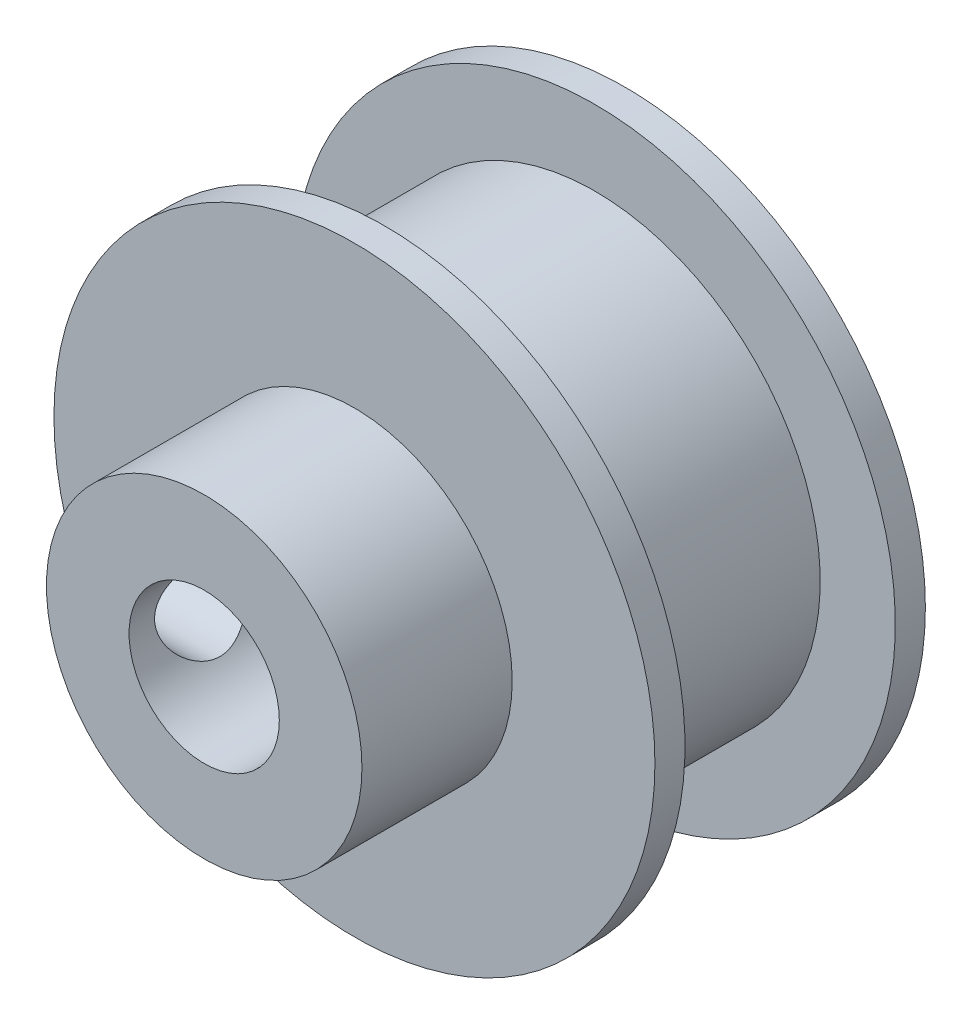
ISO-10303-21;
HEADER;
FILE_DESCRIPTION(('STEP AP214'),'2;1');
FILE_NAME('part.step','',(''),(''),'','','');
FILE_SCHEMA(('AUTOMOTIVE_DESIGN { 1 0 10303 214 1 1 1 1 }'));
ENDSEC;
DATA;
#1=APPLICATION_CONTEXT('core data for automotive mechanical design processes');
#2=APPLICATION_PROTOCOL_DEFINITION('international standard','automotive_design',2000,#1);
#3=PRODUCT_CONTEXT('',#1,'mechanical');
#4=PRODUCT('Part','Part','',(#3));
#5=PRODUCT_RELATED_PRODUCT_CATEGORY('part','',(#4));
#6=PRODUCT_DEFINITION_FORMATION('','',#4);
#7=PRODUCT_DEFINITION_CONTEXT('part definition',#1,'design');
#8=PRODUCT_DEFINITION('design','',#6,#7);
#9=PRODUCT_DEFINITION_SHAPE('','',#8);
#10=(LENGTH_UNIT() NAMED_UNIT(*) SI_UNIT(.MILLI.,.METRE.));
#11=(NAMED_UNIT(*) PLANE_ANGLE_UNIT() SI_UNIT($,.RADIAN.));
#12=(NAMED_UNIT(*) SI_UNIT($,.STERADIAN.) SOLID_ANGLE_UNIT());
#13=UNCERTAINTY_MEASURE_WITH_UNIT(LENGTH_MEASURE(1.E-05),#10,'distance_accuracy_value','');
#14=(GEOMETRIC_REPRESENTATION_CONTEXT(3) GLOBAL_UNCERTAINTY_ASSIGNED_CONTEXT((#13)) GLOBAL_UNIT_ASSIGNED_CONTEXT((#10,
#11,#12)) REPRESENTATION_CONTEXT('',''));
#15=CARTESIAN_POINT('',(0.,0.,0.));
#16=DIRECTION('',(0.,0.,1.));
#17=DIRECTION('',(1.,0.,0.));
#18=AXIS2_PLACEMENT_3D('',#15,#16,#17);
#19=CARTESIAN_POINT('',(0.,0.,9.));
#20=DIRECTION('',(0.,0.,-1.));
#21=DIRECTION('',(-1.,0.,0.));
#22=AXIS2_PLACEMENT_3D('',#19,#20,#21);
#23=CYLINDRICAL_SURFACE('',#22,10.);
#24=CARTESIAN_POINT('',(0.,0.,8.));
#25=DIRECTION('',(0.,0.,-1.));
#26=DIRECTION('',(-1.,0.,0.));
#27=AXIS2_PLACEMENT_3D('',#24,#25,#26);
#28=CIRCLE('',#27,10.);
#29=CARTESIAN_POINT('',(-10.,0.,8.));
#30=VERTEX_POINT('',#29);
#31=EDGE_CURVE('E87',#30,#30,#28,.T.);
#32=ORIENTED_EDGE('',*,*,#31,.F.);
#33=EDGE_LOOP('',(#32));
#34=FACE_BOUND('',#33,.T.);
#35=CARTESIAN_POINT('',(0.,0.,9.));
#36=DIRECTION('',(0.,0.,1.));
#37=DIRECTION('',(1.,0.,0.));
#38=AXIS2_PLACEMENT_3D('',#35,#36,#37);
#39=CIRCLE('',#38,10.);
#40=CARTESIAN_POINT('',(10.,0.,9.));
#41=VERTEX_POINT('',#40);
#42=EDGE_CURVE('E154',#41,#41,#39,.T.);
#43=ORIENTED_EDGE('',*,*,#42,.F.);
#44=EDGE_LOOP('',(#43));
#45=FACE_BOUND('',#44,.T.);
#46=ADVANCED_FACE('F41',(#34,#45),#23,.T.);
#47=CARTESIAN_POINT('',(0.,0.,1.));
#48=DIRECTION('',(0.,0.,-1.));
#49=DIRECTION('',(-1.,0.,0.));
#50=AXIS2_PLACEMENT_3D('',#47,#48,#49);
#51=CIRCLE('',#50,10.);
#52=CARTESIAN_POINT('',(-10.,0.,1.));
#53=VERTEX_POINT('',#52);
#54=EDGE_CURVE('E183',#53,#53,#51,.T.);
#55=ORIENTED_EDGE('',*,*,#54,.T.);
#56=EDGE_LOOP('',(#55));
#57=FACE_BOUND('',#56,.T.);
#58=CARTESIAN_POINT('',(0.,0.,0.));
#59=DIRECTION('',(0.,0.,1.));
#60=DIRECTION('',(1.,0.,0.));
#61=AXIS2_PLACEMENT_3D('',#58,#59,#60);
#62=CIRCLE('',#61,10.);
#63=CARTESIAN_POINT('',(10.,0.,0.));
#64=VERTEX_POINT('',#63);
#65=EDGE_CURVE('E157',#64,#64,#62,.T.);
#66=ORIENTED_EDGE('',*,*,#65,.T.);
#67=EDGE_LOOP('',(#66));
#68=FACE_BOUND('',#67,.T.);
#69=ADVANCED_FACE('F43',(#57,#68),#23,.T.);
#70=CARTESIAN_POINT('',(0.,0.,9.));
#71=DIRECTION('',(0.,0.,1.));
#72=DIRECTION('',(1.,0.,0.));
#73=AXIS2_PLACEMENT_3D('',#70,#71,#72);
#74=PLANE('',#73);
#75=CARTESIAN_POINT('',(0.,0.,9.));
#76=DIRECTION('',(0.,0.,1.));
#77=DIRECTION('',(1.,0.,0.));
#78=AXIS2_PLACEMENT_3D('',#75,#76,#77);
#79=CIRCLE('',#78,5.25);
#80=CARTESIAN_POINT('',(5.25,0.,9.));
#81=VERTEX_POINT('',#80);
#82=EDGE_CURVE('E156',#81,#81,#79,.T.);
#83=ORIENTED_EDGE('',*,*,#82,.F.);
#84=EDGE_LOOP('',(#83));
#85=FACE_BOUND('',#84,.T.);
#86=ORIENTED_EDGE('',*,*,#42,.T.);
#87=EDGE_LOOP('',(#86));
#88=FACE_BOUND('',#87,.T.);
#89=ADVANCED_FACE('F147',(#85,#88),#74,.T.);
#90=CARTESIAN_POINT('',(0.,0.,0.));
#91=DIRECTION('',(0.,0.,1.));
#92=DIRECTION('',(1.,0.,0.));
#93=AXIS2_PLACEMENT_3D('',#90,#91,#92);
#94=PLANE('',#93);
#95=CARTESIAN_POINT('',(0.,0.,0.));
#96=DIRECTION('',(0.,0.,1.));
#97=DIRECTION('',(1.,0.,0.));
#98=AXIS2_PLACEMENT_3D('',#95,#96,#97);
#99=CIRCLE('',#98,2.5);
#100=CARTESIAN_POINT('',(2.5,0.,0.));
#101=VERTEX_POINT('',#100);
#102=EDGE_CURVE('E171',#101,#101,#99,.T.);
#103=ORIENTED_EDGE('',*,*,#102,.T.);
#104=EDGE_LOOP('',(#103));
#105=FACE_BOUND('',#104,.T.);
#106=ORIENTED_EDGE('',*,*,#65,.F.);
#107=EDGE_LOOP('',(#106));
#108=FACE_BOUND('',#107,.T.);
#109=ADVANCED_FACE('F140',(#105,#108),#94,.F.);
#110=CARTESIAN_POINT('',(0.,0.,14.));
#111=DIRECTION('',(0.,0.,-1.));
#112=DIRECTION('',(-1.,0.,0.));
#113=AXIS2_PLACEMENT_3D('',#110,#111,#112);
#114=CYLINDRICAL_SURFACE('',#113,5.25);
#115=CARTESIAN_POINT('',(-5.22500000000002,0.511737237261296,10.0356669716643));
#116=CARTESIAN_POINT('',(-5.22080103619722,0.554635097301248,10.0501479931089));
#117=CARTESIAN_POINT('',(-5.21613001939512,0.596852302770394,10.0664283918862));
#118=CARTESIAN_POINT('',(-5.20598561159541,0.679668663362629,10.1024547743276));
#119=CARTESIAN_POINT('',(-5.20051242742952,0.720268232157156,10.12219986491));
#120=CARTESIAN_POINT('',(-5.18312357701325,0.839116533299654,10.1863524468429));
#121=CARTESIAN_POINT('',(-5.17021922077113,0.914602601404691,10.2357410589933));
#122=CARTESIAN_POINT('',(-5.14319959174699,1.05602988111869,10.3462751038545));
#123=CARTESIAN_POINT('',(-5.12908483575407,1.12197513425042,10.4074155327463));
#124=CARTESIAN_POINT('',(-5.10116272524832,1.24277323805254,10.5399180072716));
#125=CARTESIAN_POINT('',(-5.08735543365042,1.29762383670587,10.6112821231195));
#126=CARTESIAN_POINT('',(-5.06141329222105,1.39542168045256,10.7635246405141));
#127=CARTESIAN_POINT('',(-5.04930524808575,1.43818705900446,10.8445247427375));
#128=CARTESIAN_POINT('',(-5.02848257173113,1.50938697068997,11.0130071931971));
#129=CARTESIAN_POINT('',(-5.01976714669229,1.53782485246709,11.1004880212609));
#130=CARTESIAN_POINT('',(-5.00705901954524,1.57870481520122,11.2766392854546));
#131=CARTESIAN_POINT('',(-5.00293118044024,1.59160559661703,11.3651932992222));
#132=CARTESIAN_POINT('',(-4.99946510184609,1.60246212498404,11.5432943996505));
#133=CARTESIAN_POINT('',(-5.00012561380579,1.6004217678002,11.6328412213588));
#134=CARTESIAN_POINT('',(-5.0060351510082,1.58183331466204,11.8069515712158));
#135=CARTESIAN_POINT('',(-5.01111697890986,1.5658137920573,11.8915780750087));
#136=CARTESIAN_POINT('',(-5.02503700494419,1.520545427826,12.0568834912062));
#137=CARTESIAN_POINT('',(-5.0338755149832,1.49129548770357,12.1375620752062));
#138=CARTESIAN_POINT('',(-5.0544762327594,1.41991717051318,12.2941593045613));
#139=CARTESIAN_POINT('',(-5.06628261641096,1.3775917664671,12.3699820822786));
#140=CARTESIAN_POINT('',(-5.09146303267988,1.28139362696523,12.5136577309612));
#141=CARTESIAN_POINT('',(-5.10483785275387,1.22751507973931,12.5815065639686));
#142=CARTESIAN_POINT('',(-5.13235348739273,1.10699132098766,12.7103693617924));
#143=CARTESIAN_POINT('',(-5.1465023113191,1.03989265242724,12.7709575301468));
#144=CARTESIAN_POINT('',(-5.17343243590507,0.896327094547702,12.8800445293676));
#145=CARTESIAN_POINT('',(-5.18621549630121,0.819872539393424,12.9285590265925));
#146=CARTESIAN_POINT('',(-5.20283140388565,0.703153227415906,12.9894311658777));
#147=CARTESIAN_POINT('',(-5.2077585552216,0.665747544666807,13.0071289581377));
#148=CARTESIAN_POINT('',(-5.2169211032018,0.589662357376282,13.0395767405647));
#149=CARTESIAN_POINT('',(-5.22115749449172,0.550984782522885,13.054330976218));
#150=CARTESIAN_POINT('',(-5.22500000000002,0.511737237261295,13.0675805588235));
#151=B_SPLINE_CURVE_WITH_KNOTS('',3,(#115,#116,#117,#118,#119,#120,#121,#122,#123,#124,#125,
#126,#127,#128,#129,#130,#131,#132,#133,#134,#135,#136,#137,#138,#139,#140,#141,#142,#143,#144,
#145,#146,#147,#148,#149,#150),.UNSPECIFIED.,.F.,.F.,(4,2,2,2,2,2,2,2,2,2,2,2,2,2,2,2,2,4),(0.,
0.136319741874078,0.272604396552197,0.544583811644662,0.816447675836924,1.08836666829139,
1.36418282440651,1.63993448642652,1.90732824102346,2.17465227584298,2.43228605768438,
2.68994123428596,2.95168567846848,3.21356210251508,3.48683205761991,3.75974555675997,
3.88465610392324,4.00938516927519),.UNSPECIFIED.);
#152=CARTESIAN_POINT('',(-5.22500000000002,0.511737237261296,10.0356669716643));
#153=VERTEX_POINT('',#152);
#154=CARTESIAN_POINT('',(-5.22500000000002,0.511737237261296,13.0675805588235));
#155=VERTEX_POINT('',#154);
#156=EDGE_CURVE('E80',#153,#155,#151,.T.);
#157=ORIENTED_EDGE('',*,*,#156,.T.);
#158=CARTESIAN_POINT('',(-5.12909679801298,1.12020803273903,12.555337440143));
#159=CARTESIAN_POINT('',(-5.13826411463547,1.07822038386537,12.6159830065755));
#160=CARTESIAN_POINT('',(-5.14781634802435,1.03202682842381,12.6737950660446));
#161=CARTESIAN_POINT('',(-5.16688912497246,0.931859880861361,12.7822313797715));
#162=CARTESIAN_POINT('',(-5.1764096647593,0.877885594275595,12.8328548063014));
#163=CARTESIAN_POINT('',(-5.19234721564089,0.777135384971897,12.9138527835092));
#164=CARTESIAN_POINT('',(-5.19894649444968,0.73191626749713,12.9461299102067));
#165=CARTESIAN_POINT('',(-5.21132426074477,0.637851161324948,13.0051078657514));
#166=CARTESIAN_POINT('',(-5.21710251409383,0.58900414405854,13.0318071049325));
#167=CARTESIAN_POINT('',(-5.22972108461706,0.466615514890368,13.0890393236637));
#168=CARTESIAN_POINT('',(-5.23595817281538,0.391449562614993,13.1163256559016));
#169=CARTESIAN_POINT('',(-5.24521232137665,0.237092460817576,13.1563694110916));
#170=CARTESIAN_POINT('',(-5.24822853108555,0.15790025371901,13.1691229959144));
#171=CARTESIAN_POINT('',(-5.25047041896469,0.00762770371746231,13.1786162600624));
#172=CARTESIAN_POINT('',(-5.25008965645419,-0.0633461633388749,13.1770184712811));
#173=CARTESIAN_POINT('',(-5.2465101711667,-0.203846829170092,13.1618153086279));
#174=CARTESIAN_POINT('',(-5.24331553969529,-0.273375578936168,13.1482273681293));
#175=CARTESIAN_POINT('',(-5.23669741422096,-0.375053161349967,13.1194709492526));
#176=CARTESIAN_POINT('',(-5.23418703786353,-0.408509497367394,13.1084898512665));
#177=CARTESIAN_POINT('',(-5.22862890650519,-0.474373573280164,13.083884380508));
#178=CARTESIAN_POINT('',(-5.2255813737709,-0.506781740351819,13.0702611007946));
#179=CARTESIAN_POINT('',(-5.21491957095694,-0.610143403837617,13.0219115035516));
#180=CARTESIAN_POINT('',(-5.20635617515478,-0.678675236521848,12.9820822626832));
#181=CARTESIAN_POINT('',(-5.18784074424661,-0.808157153219885,12.8915991374801));
#182=CARTESIAN_POINT('',(-5.1778846703179,-0.869084174036394,12.8409135336315));
#183=CARTESIAN_POINT('',(-5.16111767453639,-0.962696390205229,12.7497504916187));
#184=CARTESIAN_POINT('',(-5.15440503384674,-0.997879332845713,12.7117730292411));
#185=CARTESIAN_POINT('',(-5.14112735838514,-1.06416161168926,12.6327363706653));
#186=CARTESIAN_POINT('',(-5.13456172120666,-1.09528202651037,12.5916949733104));
#187=CARTESIAN_POINT('',(-5.12817897233234,-1.12440225352336,12.5492542555224));
#188=B_SPLINE_CURVE_WITH_KNOTS('',3,(#158,#159,#160,#161,#162,#163,#164,#165,#166,#167,#168,
#169,#170,#171,#172,#173,#174,#175,#176,#177,#178,#179,#180,#181,#182,#183,#184,#185,#186,#187),
.UNSPECIFIED.,.F.,.F.,(4,2,2,2,2,2,2,2,2,2,2,2,2,2,4),(0.,0.223003454062178,0.44603256484713,
0.613496409860327,0.781007916202853,1.02018452684424,1.25942428990573,1.47134156547282,
1.68295122551975,1.78875429320758,1.89451368363557,2.13238651714968,2.37096407286555,
2.52733902825522,2.68286731752218),.UNSPECIFIED.);
#189=CARTESIAN_POINT('',(-5.22500000000002,-0.511737237261296,13.0675805588235));
#190=VERTEX_POINT('',#189);
#191=EDGE_CURVE('E11',#155,#190,#188,.T.);
#192=ORIENTED_EDGE('',*,*,#191,.T.);
#193=CARTESIAN_POINT('',(-5.22500000000002,-0.511737237261296,13.0675805588235));
#194=CARTESIAN_POINT('',(-5.22080103619722,-0.554635097301248,13.053099537379));
#195=CARTESIAN_POINT('',(-5.21613001939512,-0.596852302770394,13.0368191386017));
#196=CARTESIAN_POINT('',(-5.20598561159541,-0.679668663362629,13.0007927561602));
#197=CARTESIAN_POINT('',(-5.20051242742952,-0.720268232157156,12.9810476655778));
#198=CARTESIAN_POINT('',(-5.18312357701325,-0.839116533299655,12.916895083645));
#199=CARTESIAN_POINT('',(-5.17021922077113,-0.914602601404692,12.8675064714946));
#200=CARTESIAN_POINT('',(-5.14319959174699,-1.05602988111869,12.7569724266333));
#201=CARTESIAN_POINT('',(-5.12908483575407,-1.12197513425042,12.6958319977415));
#202=CARTESIAN_POINT('',(-5.10116272524832,-1.24277323805254,12.5633295232162));
#203=CARTESIAN_POINT('',(-5.08735543365042,-1.29762383670587,12.4919654073684));
#204=CARTESIAN_POINT('',(-5.06141329222105,-1.39542168045256,12.3397228899737));
#205=CARTESIAN_POINT('',(-5.04930524808575,-1.43818705900446,12.2587227877503));
#206=CARTESIAN_POINT('',(-5.02848257173113,-1.50938697068998,12.0902403372907));
#207=CARTESIAN_POINT('',(-5.01976714669229,-1.5378248524671,12.0027595092269));
#208=CARTESIAN_POINT('',(-5.00705901954524,-1.57870481520123,11.8266082450333));
#209=CARTESIAN_POINT('',(-5.00293118044024,-1.59160559661703,11.7380542312657));
#210=CARTESIAN_POINT('',(-4.99946510184609,-1.60246212498404,11.5599531308373));
#211=CARTESIAN_POINT('',(-5.00012561380579,-1.60042176780021,11.470406309129));
#212=CARTESIAN_POINT('',(-5.0060351510082,-1.58183331466204,11.296295959272));
#213=CARTESIAN_POINT('',(-5.01111697890987,-1.5658137920573,11.2116694554791));
#214=CARTESIAN_POINT('',(-5.02503700494419,-1.520545427826,11.0463640392816));
#215=CARTESIAN_POINT('',(-5.0338755149832,-1.49129548770357,10.9656854552817));
#216=CARTESIAN_POINT('',(-5.0544762327594,-1.41991717051318,10.8090882259265));
#217=CARTESIAN_POINT('',(-5.06628261641096,-1.3775917664671,10.7332654482093));
#218=CARTESIAN_POINT('',(-5.09146303267988,-1.28139362696523,10.5895897995266));
#219=CARTESIAN_POINT('',(-5.10483785275387,-1.22751507973931,10.5217409665192));
#220=CARTESIAN_POINT('',(-5.13235348739273,-1.10699132098766,10.3928781686954));
#221=CARTESIAN_POINT('',(-5.1465023113191,-1.03989265242725,10.332290000341));
#222=CARTESIAN_POINT('',(-5.17343243590507,-0.896327094547703,10.2232030011202));
#223=CARTESIAN_POINT('',(-5.18621549630121,-0.819872539393426,10.1746885038953));
#224=CARTESIAN_POINT('',(-5.20283140388565,-0.703153227415908,10.1138163646101));
#225=CARTESIAN_POINT('',(-5.2077585552216,-0.665747544666808,10.0961185723502));
#226=CARTESIAN_POINT('',(-5.2169211032018,-0.589662357376283,10.0636707899231));
#227=CARTESIAN_POINT('',(-5.22115749449172,-0.550984782522886,10.0489165542698));
#228=CARTESIAN_POINT('',(-5.22500000000002,-0.511737237261295,10.0356669716643));
#229=B_SPLINE_CURVE_WITH_KNOTS('',3,(#193,#194,#195,#196,#197,#198,#199,#200,#201,#202,#203,
#204,#205,#206,#207,#208,#209,#210,#211,#212,#213,#214,#215,#216,#217,#218,#219,#220,#221,#222,
#223,#224,#225,#226,#227,#228),.UNSPECIFIED.,.F.,.F.,(4,2,2,2,2,2,2,2,2,2,2,2,2,2,2,2,2,4),(0.,
0.136319741874078,0.272604396552197,0.544583811644663,0.816447675836926,1.08836666829139,
1.36418282440651,1.63993448642652,1.90732824102346,2.17465227584298,2.43228605768438,
2.68994123428596,2.95168567846848,3.21356210251508,3.48683205761991,3.75974555675997,
3.88465610392324,4.00938516927519),.UNSPECIFIED.);
#230=CARTESIAN_POINT('',(-5.22500000000002,-0.511737237261296,10.0356669716643));
#231=VERTEX_POINT('',#230);
#232=EDGE_CURVE('E68',#190,#231,#229,.T.);
#233=ORIENTED_EDGE('',*,*,#232,.T.);
#234=CARTESIAN_POINT('',(-5.12909679801298,-1.12020803273903,10.5479100903448));
#235=CARTESIAN_POINT('',(-5.13826411463547,-1.07822038386537,10.4872645239123));
#236=CARTESIAN_POINT('',(-5.14781634802435,-1.03202682842381,10.4294524644432));
#237=CARTESIAN_POINT('',(-5.16688912497246,-0.931859880861363,10.3210161507163));
#238=CARTESIAN_POINT('',(-5.1764096647593,-0.877885594275597,10.2703927241864));
#239=CARTESIAN_POINT('',(-5.19234721564089,-0.777135384971898,10.1893947469787));
#240=CARTESIAN_POINT('',(-5.19894649444968,-0.73191626749713,10.1571176202812));
#241=CARTESIAN_POINT('',(-5.21132426074477,-0.637851161324948,10.0981396647364));
#242=CARTESIAN_POINT('',(-5.21710251409383,-0.589004144058541,10.0714404255553));
#243=CARTESIAN_POINT('',(-5.22972108461706,-0.46661551489037,10.0142082068241));
#244=CARTESIAN_POINT('',(-5.23595817281538,-0.391449562614995,9.98692187458623));
#245=CARTESIAN_POINT('',(-5.24521232137665,-0.237092460817578,9.94687811939618));
#246=CARTESIAN_POINT('',(-5.24822853108555,-0.157900253719013,9.93412453457341));
#247=CARTESIAN_POINT('',(-5.25047041896469,-0.00762770371746505,9.9246312704254));
#248=CARTESIAN_POINT('',(-5.25008965645419,0.063346163338872,9.92622905920667));
#249=CARTESIAN_POINT('',(-5.2465101711667,0.203846829170089,9.94143222185994));
#250=CARTESIAN_POINT('',(-5.2433155396953,0.273375578936166,9.95502016235854));
#251=CARTESIAN_POINT('',(-5.23669741422096,0.375053161349964,9.98377658123524));
#252=CARTESIAN_POINT('',(-5.23418703786353,0.40850949736739,9.99475767922129));
#253=CARTESIAN_POINT('',(-5.22862890650519,0.474373573280159,10.0193631499798));
#254=CARTESIAN_POINT('',(-5.2255813737709,0.506781740351815,10.0329864296932));
#255=CARTESIAN_POINT('',(-5.21491957095694,0.610143403837614,10.0813360269362));
#256=CARTESIAN_POINT('',(-5.20635617515478,0.678675236521845,10.1211652678046));
#257=CARTESIAN_POINT('',(-5.18784074424661,0.808157153219882,10.2116483930077));
#258=CARTESIAN_POINT('',(-5.1778846703179,0.869084174036391,10.2623339968563));
#259=CARTESIAN_POINT('',(-5.16111767453639,0.962696390205226,10.3534970388691));
#260=CARTESIAN_POINT('',(-5.15440503384674,0.997879332845711,10.3914745012467));
#261=CARTESIAN_POINT('',(-5.14112735838514,1.06416161168926,10.4705111598225));
#262=CARTESIAN_POINT('',(-5.13456172120666,1.09528202651036,10.5115525571774));
#263=CARTESIAN_POINT('',(-5.12817897233234,1.12440225352336,10.5539932749654));
#264=B_SPLINE_CURVE_WITH_KNOTS('',3,(#234,#235,#236,#237,#238,#239,#240,#241,#242,#243,#244,
#245,#246,#247,#248,#249,#250,#251,#252,#253,#254,#255,#256,#257,#258,#259,#260,#261,#262,#263),
.UNSPECIFIED.,.F.,.F.,(4,2,2,2,2,2,2,2,2,2,2,2,2,2,4),(0.,0.223003454062176,0.44603256484713,
0.61349640986033,0.781007916202853,1.02018452684424,1.25942428990573,1.47134156547282,
1.68295122551974,1.78875429320758,1.89451368363557,2.13238651714968,2.37096407286555,
2.52733902825522,2.68286731752218),.UNSPECIFIED.);
#265=EDGE_CURVE('E55',#231,#153,#264,.T.);
#266=ORIENTED_EDGE('',*,*,#265,.T.);
#267=EDGE_LOOP('',(#157,#192,#233,#266));
#268=FACE_BOUND('',#267,.T.);
#269=CARTESIAN_POINT('',(0.,0.,14.));
#270=DIRECTION('',(0.,0.,1.));
#271=DIRECTION('',(1.,0.,0.));
#272=AXIS2_PLACEMENT_3D('',#269,#270,#271);
#273=CIRCLE('',#272,5.25);
#274=CARTESIAN_POINT('',(5.25,0.,14.));
#275=VERTEX_POINT('',#274);
#276=EDGE_CURVE('E162',#275,#275,#273,.T.);
#277=ORIENTED_EDGE('',*,*,#276,.F.);
#278=EDGE_LOOP('',(#277));
#279=FACE_BOUND('',#278,.T.);
#280=ORIENTED_EDGE('',*,*,#82,.T.);
#281=EDGE_LOOP('',(#280));
#282=FACE_BOUND('',#281,.T.);
#283=ADVANCED_FACE('F83',(#268,#279,#282),#114,.T.);
#284=CARTESIAN_POINT('',(0.,0.,14.));
#285=DIRECTION('',(0.,0.,1.));
#286=DIRECTION('',(1.,0.,0.));
#287=AXIS2_PLACEMENT_3D('',#284,#285,#286);
#288=PLANE('',#287);
#289=CARTESIAN_POINT('',(0.,0.,14.));
#290=DIRECTION('',(0.,0.,1.));
#291=DIRECTION('',(1.,0.,0.));
#292=AXIS2_PLACEMENT_3D('',#289,#290,#291);
#293=CIRCLE('',#292,2.5);
#294=CARTESIAN_POINT('',(2.5,0.,14.));
#295=VERTEX_POINT('',#294);
#296=EDGE_CURVE('E172',#295,#295,#293,.T.);
#297=ORIENTED_EDGE('',*,*,#296,.F.);
#298=EDGE_LOOP('',(#297));
#299=FACE_BOUND('',#298,.T.);
#300=ORIENTED_EDGE('',*,*,#276,.T.);
#301=EDGE_LOOP('',(#300));
#302=FACE_BOUND('',#301,.T.);
#303=ADVANCED_FACE('F131',(#299,#302),#288,.T.);
#304=CARTESIAN_POINT('',(0.,0.,0.));
#305=DIRECTION('',(0.,0.,1.));
#306=DIRECTION('',(1.,0.,0.));
#307=AXIS2_PLACEMENT_3D('',#304,#305,#306);
#308=CYLINDRICAL_SURFACE('',#307,2.5);
#309=CARTESIAN_POINT('',(-2.5,0.,13.1516237652439));
#310=CARTESIAN_POINT('',(-2.49999373478121,0.0809465291327133,13.1516169647699));
#311=CARTESIAN_POINT('',(-2.49602800483229,0.161978714239317,13.1454393458128));
#312=CARTESIAN_POINT('',(-2.48053880851594,0.321532240877508,13.1210687227592));
#313=CARTESIAN_POINT('',(-2.46900276007789,0.400049173738107,13.1028557151744));
#314=CARTESIAN_POINT('',(-2.43952804374761,0.551962103584107,13.0554981420683));
#315=CARTESIAN_POINT('',(-2.42162124050247,0.62538145134433,13.0264079447879));
#316=CARTESIAN_POINT('',(-2.38087710607185,0.766024179802998,12.9585040992608));
#317=CARTESIAN_POINT('',(-2.35804006543092,0.833247925282437,12.9196910239728));
#318=CARTESIAN_POINT('',(-2.30708893904171,0.965808013791171,12.8299573991165));
#319=CARTESIAN_POINT('',(-2.27869604004543,1.03054049909709,12.7783063186277));
#320=CARTESIAN_POINT('',(-2.2202876512534,1.15100614853988,12.6660636456034));
#321=CARTESIAN_POINT('',(-2.19026995344606,1.20672663413539,12.6054596829886));
#322=CARTESIAN_POINT('',(-2.12682160476874,1.31573031751228,12.4668871291253));
#323=CARTESIAN_POINT('',(-2.09351856777285,1.36751904529823,12.3876746827165));
#324=CARTESIAN_POINT('',(-2.03231641722275,1.4569252620881,12.2197385524775));
#325=CARTESIAN_POINT('',(-2.00440807432674,1.49456706002439,12.1310315235803));
#326=CARTESIAN_POINT('',(-1.96506941451095,1.54571994621924,11.9708869907517));
#327=CARTESIAN_POINT('',(-1.95122462500059,1.56300203311438,11.901251800598));
#328=CARTESIAN_POINT('',(-1.93085974657066,1.58809633195386,11.7592920076069));
#329=CARTESIAN_POINT('',(-1.92432852519843,1.59592293813043,11.6869716658705));
#330=CARTESIAN_POINT('',(-1.91958400971203,1.60162869479515,11.5414301483248));
#331=CARTESIAN_POINT('',(-1.9213964298311,1.59947709333702,11.4682068822065));
#332=CARTESIAN_POINT('',(-1.93310041934094,1.58530767623303,11.3233581421381));
#333=CARTESIAN_POINT('',(-1.94299865478457,1.57328171999678,11.2517340366274));
#334=CARTESIAN_POINT('',(-1.96901231320557,1.54058583436825,11.1140632220576));
#335=CARTESIAN_POINT('',(-1.9849337786339,1.5201840309724,11.0479139317939));
#336=CARTESIAN_POINT('',(-2.02122165880276,1.47159113105818,10.9198683265611));
#337=CARTESIAN_POINT('',(-2.04158954958856,1.44339744710114,10.8579734328837));
#338=CARTESIAN_POINT('',(-2.08922627037342,1.37376676759634,10.7274610574265));
#339=CARTESIAN_POINT('',(-2.11706797105538,1.33082320515131,10.6598574465981));
#340=CARTESIAN_POINT('',(-2.1739956981761,1.23564764355398,10.5320483038994));
#341=CARTESIAN_POINT('',(-2.20308316755738,1.1834046393298,10.4718516818814));
#342=CARTESIAN_POINT('',(-2.26543285211594,1.05991806168004,10.3493542582978));
#343=CARTESIAN_POINT('',(-2.29848920685381,0.986946893268193,10.2886711503979));
#344=CARTESIAN_POINT('',(-2.359688609273,0.830022968093879,10.1804502294315));
#345=CARTESIAN_POINT('',(-2.38783689397334,0.746082085718432,10.1328983729996));
#346=CARTESIAN_POINT('',(-2.43131140919962,0.586635550991734,10.0610136878947));
#347=CARTESIAN_POINT('',(-2.44807310922167,0.512753928414274,10.0339471166551));
#348=CARTESIAN_POINT('',(-2.47504180751747,0.360710175816506,9.99081694329938));
#349=CARTESIAN_POINT('',(-2.4852540740069,0.282551541195584,9.97474449706395));
#350=CARTESIAN_POINT('',(-2.49820514305433,0.123815634695003,9.95441012768328));
#351=CARTESIAN_POINT('',(-2.50091888316294,0.0432311597035587,9.95018781068579));
#352=CARTESIAN_POINT('',(-2.49852887198075,-0.117542286289563,9.95392267109636));
#353=CARTESIAN_POINT('',(-2.49342466188541,-0.197731233802229,9.96188056331266));
#354=CARTESIAN_POINT('',(-2.47637451376673,-0.351006156661024,9.98876415698832));
#355=CARTESIAN_POINT('',(-2.46480663552248,-0.424243126849568,10.0070844342513));
#356=CARTESIAN_POINT('',(-2.43607037965005,-0.566415484435882,10.0533690648413));
#357=CARTESIAN_POINT('',(-2.41890106050777,-0.635350146361167,10.0813350395036));
#358=CARTESIAN_POINT('',(-2.37877118462254,-0.772615564352517,10.1482975473017));
#359=CARTESIAN_POINT('',(-2.35547539636836,-0.840521814887449,10.1879586828756));
#360=CARTESIAN_POINT('',(-2.30558482599355,-0.969041009865649,10.2760688119935));
#361=CARTESIAN_POINT('',(-2.27898748986338,-1.02964823562874,10.3245246224776));
#362=CARTESIAN_POINT('',(-2.22016403044038,-1.15157305211654,10.4372675140945));
#363=CARTESIAN_POINT('',(-2.18769843253542,-1.21158689465292,10.5028421153157));
#364=CARTESIAN_POINT('',(-2.12390873827501,-1.3202194969544,10.6433779764445));
#365=CARTESIAN_POINT('',(-2.09258486725736,-1.36883601745304,10.7183410765076));
#366=CARTESIAN_POINT('',(-2.03864659589321,-1.44771753628644,10.8659668138547));
#367=CARTESIAN_POINT('',(-2.01542700480048,-1.47958112170676,10.9375487346355));
#368=CARTESIAN_POINT('',(-1.97524043785176,-1.53282212869391,11.0861494924319));
#369=CARTESIAN_POINT('',(-1.95826478854658,-1.55421411012882,11.1631606090772));
#370=CARTESIAN_POINT('',(-1.93305268936487,-1.58547514853104,11.3217410218225));
#371=CARTESIAN_POINT('',(-1.92489997570192,-1.59523388426507,11.4033463902373));
#372=CARTESIAN_POINT('',(-1.91925764740911,-1.60202308952287,11.5674327991989));
#373=CARTESIAN_POINT('',(-1.92176029238758,-1.59906279853819,11.6499131606895));
#374=CARTESIAN_POINT('',(-1.93577077408217,-1.58204765912499,11.8007079359784));
#375=CARTESIAN_POINT('',(-1.94592963240223,-1.56965222422198,11.8693516021848));
#376=CARTESIAN_POINT('',(-1.97224844367527,-1.53645153543921,12.0033889077636));
#377=CARTESIAN_POINT('',(-1.98841434501086,-1.51563794379521,12.0687792525625));
#378=CARTESIAN_POINT('',(-2.03132559529757,-1.45787799915051,12.2171572287867));
#379=CARTESIAN_POINT('',(-2.05979688602196,-1.41784373882589,12.2984414635022));
#380=CARTESIAN_POINT('',(-2.12039210845437,-1.3255155130248,12.4522222480758));
#381=CARTESIAN_POINT('',(-2.15252094162924,-1.27320499415654,12.5247067302645));
#382=CARTESIAN_POINT('',(-2.21734561230738,-1.15666472100031,12.6607833463047));
#383=CARTESIAN_POINT('',(-2.25004367113503,-1.09230184419141,12.7242606965424));
#384=CARTESIAN_POINT('',(-2.31251135077165,-0.952958939292195,12.8400655258567));
#385=CARTESIAN_POINT('',(-2.34228091431827,-0.877978703665193,12.8923927869333));
#386=CARTESIAN_POINT('',(-2.39686635130217,-0.715912032693976,12.9856553539899));
#387=CARTESIAN_POINT('',(-2.42149529879162,-0.6285172004562,13.0261769973612));
#388=CARTESIAN_POINT('',(-2.45158227355126,-0.491867628909326,13.0749135562974));
#389=CARTESIAN_POINT('',(-2.46046425402859,-0.445430003155364,13.0891449959718));
#390=CARTESIAN_POINT('',(-2.4756864261471,-0.351072648099775,13.113390119545));
#391=CARTESIAN_POINT('',(-2.48202839394244,-0.303153979792195,13.1234067509809));
#392=CARTESIAN_POINT('',(-2.49128524954684,-0.212785198573037,13.1379809537525));
#393=CARTESIAN_POINT('',(-2.49454442057938,-0.170458191835629,13.14308846335));
#394=CARTESIAN_POINT('',(-2.4989034737162,-0.085428750536023,13.1499117022036));
#395=CARTESIAN_POINT('',(-2.50000330699373,-0.0427263075064218,13.1516273547634));
#396=CARTESIAN_POINT('',(-2.5,0.,13.1516237652439));
#397=B_SPLINE_CURVE_WITH_KNOTS('',3,(#309,#310,#311,#312,#313,#314,#315,#316,#317,#318,#319,
#320,#321,#322,#323,#324,#325,#326,#327,#328,#329,#330,#331,#332,#333,#334,#335,#336,#337,#338,
#339,#340,#341,#342,#343,#344,#345,#346,#347,#348,#349,#350,#351,#352,#353,#354,#355,#356,#357,
#358,#359,#360,#361,#362,#363,#364,#365,#366,#367,#368,#369,#370,#371,#372,#373,#374,#375,#376,
#377,#378,#379,#380,#381,#382,#383,#384,#385,#386,#387,#388,#389,#390,#391,#392,#393,#394,#395,
#396),.UNSPECIFIED.,.T.,.F.,(4,2,2,2,2,2,2,2,2,2,2,2,2,2,2,2,2,2,2,2,2,2,2,2,2,2,2,2,2,2,2,2,2,
2,2,2,2,2,2,2,2,2,2,4),(0.,0.242668102535663,0.485740550885227,0.727613930252437,
0.969473059632693,1.23110984524596,1.4931115719164,1.79267227249294,2.09171585301314,
2.31003384448274,2.52801906643512,2.74667654507804,2.96551446997263,3.17783438970214,
3.39022489909451,3.6436785329695,3.89743412554233,4.19745900101258,4.49716175776392,
4.73748246564538,4.97760962174348,5.21853839358541,5.45948130512498,5.68761800492924,
5.91579307069752,6.16090222818187,6.40620219274234,6.68894601761172,6.9717453475492,
7.21597374489123,7.45986159214764,7.70604434827071,7.9520482999284,8.16261918551675,
8.37339914379893,8.65683208165378,8.94064942091185,9.22780941070392,9.51497501436509,
9.81124287919976,9.95914584209681,10.1069451995842,10.2350307103853,10.3631191174119),.UNSPECIFIED.);
#398=CARTESIAN_POINT('',(-2.5,0.,13.1516237652439));
#399=VERTEX_POINT('',#398);
#400=EDGE_CURVE('E85',#399,#399,#397,.T.);
#401=ORIENTED_EDGE('',*,*,#400,.T.);
#402=EDGE_LOOP('',(#401));
#403=FACE_BOUND('',#402,.T.);
#404=ORIENTED_EDGE('',*,*,#102,.F.);
#405=EDGE_LOOP('',(#404));
#406=FACE_BOUND('',#405,.T.);
#407=ORIENTED_EDGE('',*,*,#296,.T.);
#408=EDGE_LOOP('',(#407));
#409=FACE_BOUND('',#408,.T.);
#410=ADVANCED_FACE('F128',(#403,#406,#409),#308,.F.);
#411=CARTESIAN_POINT('',(0.,10.,8.));
#412=DIRECTION('',(0.,0.,1.));
#413=DIRECTION('',(1.,0.,0.));
#414=AXIS2_PLACEMENT_3D('',#411,#412,#413);
#415=PLANE('',#414);
#416=CARTESIAN_POINT('',(0.,0.,8.));
#417=DIRECTION('',(0.,0.,-1.));
#418=DIRECTION('',(-1.,0.,0.));
#419=AXIS2_PLACEMENT_3D('',#416,#417,#418);
#420=CIRCLE('',#419,7.5);
#421=CARTESIAN_POINT('',(-7.5,0.,8.));
#422=VERTEX_POINT('',#421);
#423=EDGE_CURVE('E175',#422,#422,#420,.T.);
#424=ORIENTED_EDGE('',*,*,#423,.F.);
#425=EDGE_LOOP('',(#424));
#426=FACE_BOUND('',#425,.T.);
#427=ORIENTED_EDGE('',*,*,#31,.T.);
#428=EDGE_LOOP('',(#427));
#429=FACE_BOUND('',#428,.T.);
#430=ADVANCED_FACE('F124',(#426,#429),#415,.F.);
#431=CARTESIAN_POINT('',(0.,0.,0.));
#432=DIRECTION('',(0.,0.,-1.));
#433=DIRECTION('',(-1.,0.,0.));
#434=AXIS2_PLACEMENT_3D('',#431,#432,#433);
#435=CYLINDRICAL_SURFACE('',#434,7.5);
#436=CARTESIAN_POINT('',(0.,0.,1.));
#437=DIRECTION('',(0.,0.,-1.));
#438=DIRECTION('',(-1.,0.,0.));
#439=AXIS2_PLACEMENT_3D('',#436,#437,#438);
#440=CIRCLE('',#439,7.5);
#441=CARTESIAN_POINT('',(-7.5,0.,1.));
#442=VERTEX_POINT('',#441);
#443=EDGE_CURVE('E180',#442,#442,#440,.T.);
#444=ORIENTED_EDGE('',*,*,#443,.F.);
#445=EDGE_LOOP('',(#444));
#446=FACE_BOUND('',#445,.T.);
#447=ORIENTED_EDGE('',*,*,#423,.T.);
#448=EDGE_LOOP('',(#447));
#449=FACE_BOUND('',#448,.T.);
#450=ADVANCED_FACE('F120',(#446,#449),#435,.T.);
#451=CARTESIAN_POINT('',(0.,10.,1.));
#452=DIRECTION('',(0.,0.,-1.));
#453=DIRECTION('',(-1.,0.,0.));
#454=AXIS2_PLACEMENT_3D('',#451,#452,#453);
#455=PLANE('',#454);
#456=ORIENTED_EDGE('',*,*,#54,.F.);
#457=EDGE_LOOP('',(#456));
#458=FACE_BOUND('',#457,.T.);
#459=ORIENTED_EDGE('',*,*,#443,.T.);
#460=EDGE_LOOP('',(#459));
#461=FACE_BOUND('',#460,.T.);
#462=ADVANCED_FACE('F117',(#458,#461),#455,.F.);
#463=CARTESIAN_POINT('',(-5.25,0.,11.5516237652439));
#464=DIRECTION('',(-1.,0.,0.));
#465=DIRECTION('',(0.,0.,1.));
#466=AXIS2_PLACEMENT_3D('',#463,#464,#465);
#467=CONICAL_SURFACE('',#466,1.625,0.785398163398003);
#468=CARTESIAN_POINT('',(-5.22500000000002,0.,11.5516237652439));
#469=DIRECTION('',(-1.,0.,0.));
#470=DIRECTION('',(0.,0.,1.));
#471=AXIS2_PLACEMENT_3D('',#468,#469,#470);
#472=CIRCLE('',#471,1.59999999999999);
#473=EDGE_CURVE('E76',#190,#155,#472,.T.);
#474=ORIENTED_EDGE('',*,*,#473,.F.);
#475=ORIENTED_EDGE('',*,*,#191,.F.);
#476=EDGE_LOOP('',(#474,#475));
#477=FACE_BOUND('',#476,.T.);
#478=ADVANCED_FACE('F75',(#477),#467,.F.);
#479=EDGE_CURVE('E61',#153,#231,#472,.T.);
#480=ORIENTED_EDGE('',*,*,#479,.F.);
#481=ORIENTED_EDGE('',*,*,#265,.F.);
#482=EDGE_LOOP('',(#480,#481));
#483=FACE_BOUND('',#482,.T.);
#484=ADVANCED_FACE('F110',(#483),#467,.F.);
#485=CARTESIAN_POINT('',(-5.25,0.,11.5516237652439));
#486=DIRECTION('',(-1.,0.,0.));
#487=DIRECTION('',(0.,0.,1.));
#488=AXIS2_PLACEMENT_3D('',#485,#486,#487);
#489=CYLINDRICAL_SURFACE('',#488,1.59999999999999);
#490=ORIENTED_EDGE('',*,*,#400,.F.);
#491=EDGE_LOOP('',(#490));
#492=FACE_BOUND('',#491,.T.);
#493=ORIENTED_EDGE('',*,*,#473,.T.);
#494=ORIENTED_EDGE('',*,*,#156,.F.);
#495=ORIENTED_EDGE('',*,*,#479,.T.);
#496=ORIENTED_EDGE('',*,*,#232,.F.);
#497=EDGE_LOOP('',(#493,#494,#495,#496));
#498=FACE_BOUND('',#497,.T.);
#499=ADVANCED_FACE('F79',(#492,#498),#489,.F.);
#500=CLOSED_SHELL('',(#46,#69,#89,#109,#283,#303,#410,#430,#450,#462,#478,#484,#499));
#501=MANIFOLD_SOLID_BREP('B2',#500);
#502=ADVANCED_BREP_SHAPE_REPRESENTATION('',(#18,#501),#14);
#503=SHAPE_DEFINITION_REPRESENTATION(#9,#502);
ENDSEC;
END-ISO-10303-21;
